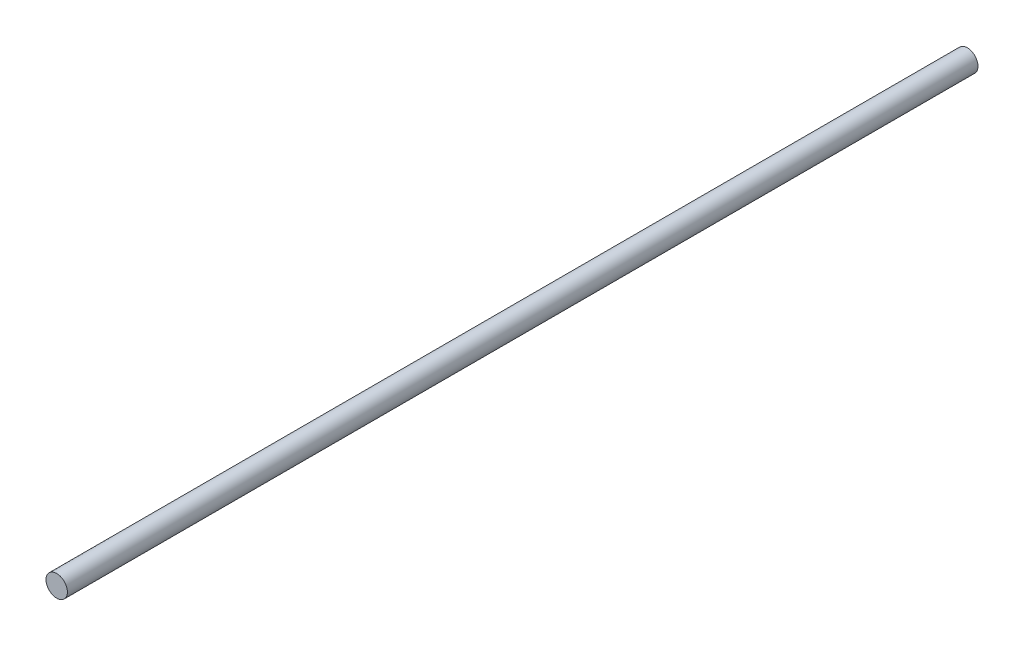
ISO-10303-21;
HEADER;
FILE_DESCRIPTION(('STEP AP214'),'2;1');
FILE_NAME('part.step','',(''),(''),'','','');
FILE_SCHEMA(('AUTOMOTIVE_DESIGN { 1 0 10303 214 1 1 1 1 }'));
ENDSEC;
DATA;
#1=APPLICATION_CONTEXT('core data for automotive mechanical design processes');
#2=APPLICATION_PROTOCOL_DEFINITION('international standard','automotive_design',2000,#1);
#3=PRODUCT_CONTEXT('',#1,'mechanical');
#4=PRODUCT('Part','Part','',(#3));
#5=PRODUCT_RELATED_PRODUCT_CATEGORY('part','',(#4));
#6=PRODUCT_DEFINITION_FORMATION('','',#4);
#7=PRODUCT_DEFINITION_CONTEXT('part definition',#1,'design');
#8=PRODUCT_DEFINITION('design','',#6,#7);
#9=PRODUCT_DEFINITION_SHAPE('','',#8);
#10=(LENGTH_UNIT() NAMED_UNIT(*) SI_UNIT(.MILLI.,.METRE.));
#11=(NAMED_UNIT(*) PLANE_ANGLE_UNIT() SI_UNIT($,.RADIAN.));
#12=(NAMED_UNIT(*) SI_UNIT($,.STERADIAN.) SOLID_ANGLE_UNIT());
#13=UNCERTAINTY_MEASURE_WITH_UNIT(LENGTH_MEASURE(1.E-05),#10,'distance_accuracy_value','');
#14=(GEOMETRIC_REPRESENTATION_CONTEXT(3) GLOBAL_UNCERTAINTY_ASSIGNED_CONTEXT((#13)) GLOBAL_UNIT_ASSIGNED_CONTEXT((#10,
#11,#12)) REPRESENTATION_CONTEXT('',''));
#15=CARTESIAN_POINT('',(0.,0.,0.));
#16=DIRECTION('',(0.,0.,1.));
#17=DIRECTION('',(1.,0.,0.));
#18=AXIS2_PLACEMENT_3D('',#15,#16,#17);
#19=CARTESIAN_POINT('',(0.,0.,340.));
#20=DIRECTION('',(0.,0.,-1.));
#21=DIRECTION('',(-1.,0.,0.));
#22=AXIS2_PLACEMENT_3D('',#19,#20,#21);
#23=CYLINDRICAL_SURFACE('',#22,4.);
#24=CARTESIAN_POINT('',(0.,0.,340.));
#25=DIRECTION('',(0.,0.,1.));
#26=DIRECTION('',(1.,0.,0.));
#27=AXIS2_PLACEMENT_3D('',#24,#25,#26);
#28=CIRCLE('',#27,4.);
#29=CARTESIAN_POINT('',(4.,0.,340.));
#30=VERTEX_POINT('',#29);
#31=EDGE_CURVE('E10',#30,#30,#28,.T.);
#32=ORIENTED_EDGE('',*,*,#31,.F.);
#33=EDGE_LOOP('',(#32));
#34=FACE_BOUND('',#33,.T.);
#35=CARTESIAN_POINT('',(0.,0.,0.));
#36=DIRECTION('',(0.,0.,1.));
#37=DIRECTION('',(1.,0.,0.));
#38=AXIS2_PLACEMENT_3D('',#35,#36,#37);
#39=CIRCLE('',#38,4.);
#40=CARTESIAN_POINT('',(4.,0.,0.));
#41=VERTEX_POINT('',#40);
#42=EDGE_CURVE('E34',#41,#41,#39,.T.);
#43=ORIENTED_EDGE('',*,*,#42,.T.);
#44=EDGE_LOOP('',(#43));
#45=FACE_BOUND('',#44,.T.);
#46=ADVANCED_FACE('F31',(#34,#45),#23,.T.);
#47=CARTESIAN_POINT('',(0.,0.,340.));
#48=DIRECTION('',(0.,0.,1.));
#49=DIRECTION('',(1.,0.,0.));
#50=AXIS2_PLACEMENT_3D('',#47,#48,#49);
#51=PLANE('',#50);
#52=ORIENTED_EDGE('',*,*,#31,.T.);
#53=EDGE_LOOP('',(#52));
#54=FACE_BOUND('',#53,.T.);
#55=ADVANCED_FACE('F46',(#54),#51,.T.);
#56=CARTESIAN_POINT('',(0.,0.,0.));
#57=DIRECTION('',(0.,0.,1.));
#58=DIRECTION('',(1.,0.,0.));
#59=AXIS2_PLACEMENT_3D('',#56,#57,#58);
#60=PLANE('',#59);
#61=ORIENTED_EDGE('',*,*,#42,.F.);
#62=EDGE_LOOP('',(#61));
#63=FACE_BOUND('',#62,.T.);
#64=ADVANCED_FACE('F44',(#63),#60,.F.);
#65=CLOSED_SHELL('',(#46,#55,#64));
#66=MANIFOLD_SOLID_BREP('B2',#65);
#67=ADVANCED_BREP_SHAPE_REPRESENTATION('',(#18,#66),#14);
#68=SHAPE_DEFINITION_REPRESENTATION(#9,#67);
ENDSEC;
END-ISO-10303-21;
